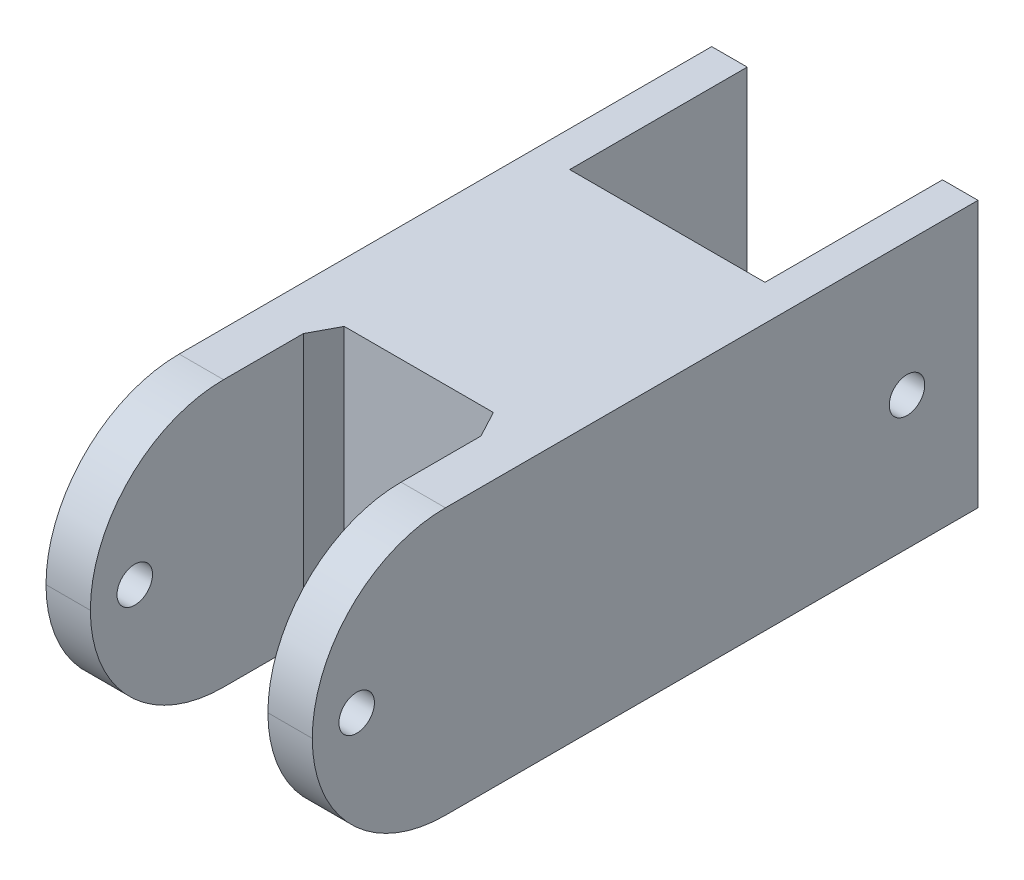
ISO-10303-21;
HEADER;
FILE_DESCRIPTION(('STEP AP214'),'2;1');
FILE_NAME('part.step','',(''),(''),'','','');
FILE_SCHEMA(('AUTOMOTIVE_DESIGN { 1 0 10303 214 1 1 1 1 }'));
ENDSEC;
DATA;
#1=APPLICATION_CONTEXT('core data for automotive mechanical design processes');
#2=APPLICATION_PROTOCOL_DEFINITION('international standard','automotive_design',2000,#1);
#3=PRODUCT_CONTEXT('',#1,'mechanical');
#4=PRODUCT('Part','Part','',(#3));
#5=PRODUCT_RELATED_PRODUCT_CATEGORY('part','',(#4));
#6=PRODUCT_DEFINITION_FORMATION('','',#4);
#7=PRODUCT_DEFINITION_CONTEXT('part definition',#1,'design');
#8=PRODUCT_DEFINITION('design','',#6,#7);
#9=PRODUCT_DEFINITION_SHAPE('','',#8);
#10=(LENGTH_UNIT() NAMED_UNIT(*) SI_UNIT(.MILLI.,.METRE.));
#11=(NAMED_UNIT(*) PLANE_ANGLE_UNIT() SI_UNIT($,.RADIAN.));
#12=(NAMED_UNIT(*) SI_UNIT($,.STERADIAN.) SOLID_ANGLE_UNIT());
#13=UNCERTAINTY_MEASURE_WITH_UNIT(LENGTH_MEASURE(1.E-05),#10,'distance_accuracy_value','');
#14=(GEOMETRIC_REPRESENTATION_CONTEXT(3) GLOBAL_UNCERTAINTY_ASSIGNED_CONTEXT((#13)) GLOBAL_UNIT_ASSIGNED_CONTEXT((#10,
#11,#12)) REPRESENTATION_CONTEXT('',''));
#15=CARTESIAN_POINT('',(0.,0.,0.));
#16=DIRECTION('',(0.,0.,1.));
#17=DIRECTION('',(1.,0.,0.));
#18=AXIS2_PLACEMENT_3D('',#15,#16,#17);
#19=CARTESIAN_POINT('',(0.,0.,-63.5));
#20=DIRECTION('',(0.,0.,-1.));
#21=DIRECTION('',(-1.,0.,0.));
#22=AXIS2_PLACEMENT_3D('',#19,#20,#21);
#23=PLANE('',#22);
#24=DIRECTION('',(-1.,0.,0.));
#25=VECTOR('',#24,1.);
#26=CARTESIAN_POINT('',(38.1,-19.05,-63.5));
#27=LINE('',#26,#25);
#28=CARTESIAN_POINT('',(33.02,-19.05,-63.5));
#29=VERTEX_POINT('',#28);
#30=CARTESIAN_POINT('',(5.08000000000001,-19.05,-63.5));
#31=VERTEX_POINT('',#30);
#32=EDGE_CURVE('E55',#29,#31,#27,.T.);
#33=ORIENTED_EDGE('',*,*,#32,.T.);
#34=DIRECTION('',(0.,-1.,0.));
#35=VECTOR('',#34,1.);
#36=CARTESIAN_POINT('',(5.08,19.05,-63.5));
#37=LINE('',#36,#35);
#38=CARTESIAN_POINT('',(5.07999999999999,19.05,-63.5));
#39=VERTEX_POINT('',#38);
#40=EDGE_CURVE('E50',#39,#31,#37,.T.);
#41=ORIENTED_EDGE('',*,*,#40,.F.);
#42=DIRECTION('',(1.,0.,0.));
#43=VECTOR('',#42,1.);
#44=CARTESIAN_POINT('',(0.,19.05,-63.5));
#45=LINE('',#44,#43);
#46=CARTESIAN_POINT('',(33.02,19.05,-63.5));
#47=VERTEX_POINT('',#46);
#48=EDGE_CURVE('E204',#39,#47,#45,.T.);
#49=ORIENTED_EDGE('',*,*,#48,.T.);
#50=DIRECTION('',(0.,1.,0.));
#51=VECTOR('',#50,1.);
#52=CARTESIAN_POINT('',(33.02,19.05,-63.5));
#53=LINE('',#52,#51);
#54=EDGE_CURVE('E184',#29,#47,#53,.T.);
#55=ORIENTED_EDGE('',*,*,#54,.F.);
#56=EDGE_LOOP('',(#33,#41,#49,#55));
#57=FACE_BOUND('',#56,.T.);
#58=ADVANCED_FACE('F33',(#57),#23,.T.);
#59=CARTESIAN_POINT('',(0.,19.05,0.));
#60=DIRECTION('',(0.,-1.,0.));
#61=DIRECTION('',(0.,0.,-1.));
#62=AXIS2_PLACEMENT_3D('',#59,#60,#61);
#63=PLANE('',#62);
#64=DIRECTION('',(0.,0.,1.));
#65=VECTOR('',#64,1.);
#66=CARTESIAN_POINT('',(0.,19.05,0.));
#67=LINE('',#66,#65);
#68=CARTESIAN_POINT('',(0.,19.05,-88.9));
#69=VERTEX_POINT('',#68);
#70=CARTESIAN_POINT('',(0.,19.05,-12.7));
#71=VERTEX_POINT('',#70);
#72=EDGE_CURVE('E145',#69,#71,#67,.T.);
#73=ORIENTED_EDGE('',*,*,#72,.T.);
#74=DIRECTION('',(1.,0.,0.));
#75=VECTOR('',#74,1.);
#76=CARTESIAN_POINT('',(0.,19.05,-12.7));
#77=LINE('',#76,#75);
#78=CARTESIAN_POINT('',(6.34999999999999,19.05,-12.7));
#79=VERTEX_POINT('',#78);
#80=EDGE_CURVE('E276',#71,#79,#77,.T.);
#81=ORIENTED_EDGE('',*,*,#80,.T.);
#82=DIRECTION('',(0.,0.,1.));
#83=VECTOR('',#82,1.);
#84=CARTESIAN_POINT('',(6.34999999999999,19.05,0.));
#85=LINE('',#84,#83);
#86=CARTESIAN_POINT('',(6.34999999999999,19.05,-24.13));
#87=VERTEX_POINT('',#86);
#88=EDGE_CURVE('E219',#87,#79,#85,.T.);
#89=ORIENTED_EDGE('',*,*,#88,.F.);
#90=DIRECTION('',(-0.470588235294118,0.,0.882352941176471));
#91=VECTOR('',#90,1.);
#92=CARTESIAN_POINT('',(8.38199999999999,19.05,-27.94));
#93=LINE('',#92,#91);
#94=CARTESIAN_POINT('',(8.38199999999999,19.05,-27.94));
#95=VERTEX_POINT('',#94);
#96=EDGE_CURVE('E216',#95,#87,#93,.T.);
#97=ORIENTED_EDGE('',*,*,#96,.F.);
#98=DIRECTION('',(-1.,0.,0.));
#99=VECTOR('',#98,1.);
#100=CARTESIAN_POINT('',(29.718,19.05,-27.94));
#101=LINE('',#100,#99);
#102=CARTESIAN_POINT('',(29.718,19.05,-27.94));
#103=VERTEX_POINT('',#102);
#104=EDGE_CURVE('E213',#103,#95,#101,.T.);
#105=ORIENTED_EDGE('',*,*,#104,.F.);
#106=DIRECTION('',(-0.470588235294116,0.,-0.882352941176472));
#107=VECTOR('',#106,1.);
#108=CARTESIAN_POINT('',(31.75,19.05,-24.13));
#109=LINE('',#108,#107);
#110=CARTESIAN_POINT('',(31.75,19.05,-24.13));
#111=VERTEX_POINT('',#110);
#112=EDGE_CURVE('E209',#111,#103,#109,.T.);
#113=ORIENTED_EDGE('',*,*,#112,.F.);
#114=DIRECTION('',(0.,0.,-1.));
#115=VECTOR('',#114,1.);
#116=CARTESIAN_POINT('',(31.75,19.05,0.));
#117=LINE('',#116,#115);
#118=CARTESIAN_POINT('',(31.75,19.05,-12.7));
#119=VERTEX_POINT('',#118);
#120=EDGE_CURVE('E207',#119,#111,#117,.T.);
#121=ORIENTED_EDGE('',*,*,#120,.F.);
#122=DIRECTION('',(1.,0.,0.));
#123=VECTOR('',#122,1.);
#124=CARTESIAN_POINT('',(0.,19.05,-12.7));
#125=LINE('',#124,#123);
#126=CARTESIAN_POINT('',(38.1,19.05,-12.7));
#127=VERTEX_POINT('',#126);
#128=EDGE_CURVE('E273',#119,#127,#125,.T.);
#129=ORIENTED_EDGE('',*,*,#128,.T.);
#130=DIRECTION('',(0.,0.,-1.));
#131=VECTOR('',#130,1.);
#132=CARTESIAN_POINT('',(38.1,19.05,0.));
#133=LINE('',#132,#131);
#134=CARTESIAN_POINT('',(38.1,19.05,-88.9));
#135=VERTEX_POINT('',#134);
#136=EDGE_CURVE('E156',#127,#135,#133,.T.);
#137=ORIENTED_EDGE('',*,*,#136,.T.);
#138=DIRECTION('',(1.,0.,0.));
#139=VECTOR('',#138,1.);
#140=CARTESIAN_POINT('',(38.1,19.05,-88.9));
#141=LINE('',#140,#139);
#142=CARTESIAN_POINT('',(33.02,19.05,-88.9));
#143=VERTEX_POINT('',#142);
#144=EDGE_CURVE('E192',#143,#135,#141,.T.);
#145=ORIENTED_EDGE('',*,*,#144,.F.);
#146=DIRECTION('',(0.,0.,1.));
#147=VECTOR('',#146,1.);
#148=CARTESIAN_POINT('',(33.02,19.05,-88.9));
#149=LINE('',#148,#147);
#150=EDGE_CURVE('E195',#143,#47,#149,.T.);
#151=ORIENTED_EDGE('',*,*,#150,.T.);
#152=ORIENTED_EDGE('',*,*,#48,.F.);
#153=DIRECTION('',(0.,0.,1.));
#154=VECTOR('',#153,1.);
#155=CARTESIAN_POINT('',(5.08,19.05,-88.9));
#156=LINE('',#155,#154);
#157=CARTESIAN_POINT('',(5.08,19.05,-88.9));
#158=VERTEX_POINT('',#157);
#159=EDGE_CURVE('E163',#158,#39,#156,.T.);
#160=ORIENTED_EDGE('',*,*,#159,.F.);
#161=DIRECTION('',(1.,0.,0.));
#162=VECTOR('',#161,1.);
#163=CARTESIAN_POINT('',(0.,19.05,-88.9));
#164=LINE('',#163,#162);
#165=EDGE_CURVE('E160',#69,#158,#164,.T.);
#166=ORIENTED_EDGE('',*,*,#165,.F.);
#167=EDGE_LOOP('',(#73,#81,#89,#97,#105,#113,#121,#129,#137,#145,#151,#152,#160,#166));
#168=FACE_BOUND('',#167,.T.);
#169=ADVANCED_FACE('F161',(#168),#63,.F.);
#170=CARTESIAN_POINT('',(0.,-19.05,0.));
#171=DIRECTION('',(0.,-1.,0.));
#172=DIRECTION('',(0.,0.,-1.));
#173=AXIS2_PLACEMENT_3D('',#170,#171,#172);
#174=PLANE('',#173);
#175=DIRECTION('',(0.,0.,1.));
#176=VECTOR('',#175,1.);
#177=CARTESIAN_POINT('',(6.34999999999999,-19.05,0.));
#178=LINE('',#177,#176);
#179=CARTESIAN_POINT('',(6.34999999999999,-19.05,-24.13));
#180=VERTEX_POINT('',#179);
#181=CARTESIAN_POINT('',(6.34999999999999,-19.05,-12.7));
#182=VERTEX_POINT('',#181);
#183=EDGE_CURVE('E233',#180,#182,#178,.T.);
#184=ORIENTED_EDGE('',*,*,#183,.T.);
#185=DIRECTION('',(1.,0.,0.));
#186=VECTOR('',#185,1.);
#187=CARTESIAN_POINT('',(0.,-19.05,-12.7));
#188=LINE('',#187,#186);
#189=CARTESIAN_POINT('',(0.,-19.05,-12.7));
#190=VERTEX_POINT('',#189);
#191=EDGE_CURVE('E267',#182,#190,#188,.F.);
#192=ORIENTED_EDGE('',*,*,#191,.T.);
#193=DIRECTION('',(0.,0.,1.));
#194=VECTOR('',#193,1.);
#195=CARTESIAN_POINT('',(0.,-19.05,0.));
#196=LINE('',#195,#194);
#197=CARTESIAN_POINT('',(0.,-19.05,-88.9));
#198=VERTEX_POINT('',#197);
#199=EDGE_CURVE('E247',#198,#190,#196,.T.);
#200=ORIENTED_EDGE('',*,*,#199,.F.);
#201=DIRECTION('',(-1.,0.,0.));
#202=VECTOR('',#201,1.);
#203=CARTESIAN_POINT('',(0.,-19.05,-88.9));
#204=LINE('',#203,#202);
#205=CARTESIAN_POINT('',(5.07999999999999,-19.05,-88.9));
#206=VERTEX_POINT('',#205);
#207=EDGE_CURVE('E171',#206,#198,#204,.T.);
#208=ORIENTED_EDGE('',*,*,#207,.F.);
#209=DIRECTION('',(0.,0.,1.));
#210=VECTOR('',#209,1.);
#211=CARTESIAN_POINT('',(5.07999999999999,-19.05,-88.9));
#212=LINE('',#211,#210);
#213=EDGE_CURVE('E179',#206,#31,#212,.T.);
#214=ORIENTED_EDGE('',*,*,#213,.T.);
#215=ORIENTED_EDGE('',*,*,#32,.F.);
#216=DIRECTION('',(0.,0.,1.));
#217=VECTOR('',#216,1.);
#218=CARTESIAN_POINT('',(33.02,-19.05,-88.9));
#219=LINE('',#218,#217);
#220=CARTESIAN_POINT('',(33.02,-19.05,-88.9));
#221=VERTEX_POINT('',#220);
#222=EDGE_CURVE('E200',#221,#29,#219,.T.);
#223=ORIENTED_EDGE('',*,*,#222,.F.);
#224=DIRECTION('',(-1.,0.,0.));
#225=VECTOR('',#224,1.);
#226=CARTESIAN_POINT('',(38.1,-19.05,-88.9));
#227=LINE('',#226,#225);
#228=CARTESIAN_POINT('',(38.1,-19.05,-88.9));
#229=VERTEX_POINT('',#228);
#230=EDGE_CURVE('E188',#229,#221,#227,.T.);
#231=ORIENTED_EDGE('',*,*,#230,.F.);
#232=DIRECTION('',(0.,0.,-1.));
#233=VECTOR('',#232,1.);
#234=CARTESIAN_POINT('',(38.1,-19.05,0.));
#235=LINE('',#234,#233);
#236=CARTESIAN_POINT('',(38.1,-19.05,-12.7));
#237=VERTEX_POINT('',#236);
#238=EDGE_CURVE('E157',#237,#229,#235,.T.);
#239=ORIENTED_EDGE('',*,*,#238,.F.);
#240=DIRECTION('',(1.,0.,0.));
#241=VECTOR('',#240,1.);
#242=CARTESIAN_POINT('',(31.75,-19.05,-12.7));
#243=LINE('',#242,#241);
#244=CARTESIAN_POINT('',(31.75,-19.05,-12.7));
#245=VERTEX_POINT('',#244);
#246=EDGE_CURVE('E265',#237,#245,#243,.F.);
#247=ORIENTED_EDGE('',*,*,#246,.T.);
#248=DIRECTION('',(0.,0.,-1.));
#249=VECTOR('',#248,1.);
#250=CARTESIAN_POINT('',(31.75,-19.05,0.));
#251=LINE('',#250,#249);
#252=CARTESIAN_POINT('',(31.75,-19.05,-24.13));
#253=VERTEX_POINT('',#252);
#254=EDGE_CURVE('E222',#245,#253,#251,.T.);
#255=ORIENTED_EDGE('',*,*,#254,.T.);
#256=DIRECTION('',(-0.470588235294116,0.,-0.882352941176472));
#257=VECTOR('',#256,1.);
#258=CARTESIAN_POINT('',(31.75,-19.05,-24.13));
#259=LINE('',#258,#257);
#260=CARTESIAN_POINT('',(29.718,-19.05,-27.94));
#261=VERTEX_POINT('',#260);
#262=EDGE_CURVE('E224',#253,#261,#259,.T.);
#263=ORIENTED_EDGE('',*,*,#262,.T.);
#264=DIRECTION('',(-1.,0.,0.));
#265=VECTOR('',#264,1.);
#266=CARTESIAN_POINT('',(29.718,-19.05,-27.94));
#267=LINE('',#266,#265);
#268=CARTESIAN_POINT('',(8.38199999999999,-19.05,-27.94));
#269=VERTEX_POINT('',#268);
#270=EDGE_CURVE('E227',#261,#269,#267,.T.);
#271=ORIENTED_EDGE('',*,*,#270,.T.);
#272=DIRECTION('',(-0.470588235294118,0.,0.882352941176471));
#273=VECTOR('',#272,1.);
#274=CARTESIAN_POINT('',(8.38199999999999,-19.05,-27.94));
#275=LINE('',#274,#273);
#276=EDGE_CURVE('E230',#269,#180,#275,.T.);
#277=ORIENTED_EDGE('',*,*,#276,.T.);
#278=EDGE_LOOP('',(#184,#192,#200,#208,#214,#215,#223,#231,#239,#247,#255,#263,#271,#277));
#279=FACE_BOUND('',#278,.T.);
#280=ADVANCED_FACE('F301',(#279),#174,.T.);
#281=CARTESIAN_POINT('',(0.,0.,0.));
#282=DIRECTION('',(1.,0.,0.));
#283=DIRECTION('',(0.,0.,-1.));
#284=AXIS2_PLACEMENT_3D('',#281,#282,#283);
#285=CYLINDRICAL_SURFACE('',#284,2.54);
#286=CARTESIAN_POINT('',(38.1,0.,0.));
#287=DIRECTION('',(-1.,0.,0.));
#288=DIRECTION('',(0.,0.,1.));
#289=AXIS2_PLACEMENT_3D('',#286,#287,#288);
#290=CIRCLE('',#289,2.54);
#291=CARTESIAN_POINT('',(38.1,0.,2.54));
#292=VERTEX_POINT('',#291);
#293=EDGE_CURVE('E250',#292,#292,#290,.T.);
#294=ORIENTED_EDGE('',*,*,#293,.F.);
#295=EDGE_LOOP('',(#294));
#296=FACE_BOUND('',#295,.T.);
#297=CARTESIAN_POINT('',(31.75,0.,0.));
#298=DIRECTION('',(1.,0.,0.));
#299=DIRECTION('',(0.,0.,-1.));
#300=AXIS2_PLACEMENT_3D('',#297,#298,#299);
#301=CIRCLE('',#300,2.54);
#302=CARTESIAN_POINT('',(31.75,0.,-2.54));
#303=VERTEX_POINT('',#302);
#304=EDGE_CURVE('E258',#303,#303,#301,.F.);
#305=ORIENTED_EDGE('',*,*,#304,.T.);
#306=EDGE_LOOP('',(#305));
#307=FACE_BOUND('',#306,.T.);
#308=ADVANCED_FACE('F364',(#296,#307),#285,.F.);
#309=CARTESIAN_POINT('',(0.,0.,0.));
#310=DIRECTION('',(1.,0.,0.));
#311=DIRECTION('',(0.,0.,-1.));
#312=AXIS2_PLACEMENT_3D('',#309,#310,#311);
#313=CIRCLE('',#312,2.54);
#314=CARTESIAN_POINT('',(0.,0.,-2.53999999999999));
#315=VERTEX_POINT('',#314);
#316=EDGE_CURVE('E239',#315,#315,#313,.T.);
#317=ORIENTED_EDGE('',*,*,#316,.F.);
#318=EDGE_LOOP('',(#317));
#319=FACE_BOUND('',#318,.T.);
#320=CARTESIAN_POINT('',(6.34999999999999,0.,0.));
#321=DIRECTION('',(-1.,0.,0.));
#322=DIRECTION('',(0.,0.,1.));
#323=AXIS2_PLACEMENT_3D('',#320,#321,#322);
#324=CIRCLE('',#323,2.54);
#325=CARTESIAN_POINT('',(6.34999999999999,0.,2.54000000000001));
#326=VERTEX_POINT('',#325);
#327=EDGE_CURVE('E255',#326,#326,#324,.F.);
#328=ORIENTED_EDGE('',*,*,#327,.T.);
#329=EDGE_LOOP('',(#328));
#330=FACE_BOUND('',#329,.T.);
#331=ADVANCED_FACE('F366',(#319,#330),#285,.F.);
#332=CARTESIAN_POINT('',(0.,19.05,0.));
#333=DIRECTION('',(1.,0.,0.));
#334=DIRECTION('',(0.,0.,-1.));
#335=AXIS2_PLACEMENT_3D('',#332,#333,#334);
#336=PLANE('',#335);
#337=CARTESIAN_POINT('',(0.,0.,-78.74));
#338=DIRECTION('',(1.,0.,0.));
#339=DIRECTION('',(0.,0.,-1.));
#340=AXIS2_PLACEMENT_3D('',#337,#338,#339);
#341=CIRCLE('',#340,2.54);
#342=CARTESIAN_POINT('',(0.,0.,-81.28));
#343=VERTEX_POINT('',#342);
#344=EDGE_CURVE('E382',#343,#343,#341,.T.);
#345=ORIENTED_EDGE('',*,*,#344,.T.);
#346=EDGE_LOOP('',(#345));
#347=FACE_BOUND('',#346,.T.);
#348=ORIENTED_EDGE('',*,*,#199,.T.);
#349=CARTESIAN_POINT('',(0.,0.,-12.7));
#350=DIRECTION('',(1.,0.,0.));
#351=DIRECTION('',(0.,0.,-1.));
#352=AXIS2_PLACEMENT_3D('',#349,#350,#351);
#353=CIRCLE('',#352,19.05);
#354=CARTESIAN_POINT('',(0.,0.,6.35));
#355=VERTEX_POINT('',#354);
#356=EDGE_CURVE('E271',#190,#355,#353,.F.);
#357=ORIENTED_EDGE('',*,*,#356,.T.);
#358=CARTESIAN_POINT('',(0.,0.,-12.7));
#359=DIRECTION('',(1.,0.,0.));
#360=DIRECTION('',(0.,0.,-1.));
#361=AXIS2_PLACEMENT_3D('',#358,#359,#360);
#362=CIRCLE('',#361,19.05);
#363=EDGE_CURVE('E153',#355,#71,#362,.F.);
#364=ORIENTED_EDGE('',*,*,#363,.T.);
#365=ORIENTED_EDGE('',*,*,#72,.F.);
#366=DIRECTION('',(0.,1.,0.));
#367=VECTOR('',#366,1.);
#368=CARTESIAN_POINT('',(0.,19.05,-88.9));
#369=LINE('',#368,#367);
#370=EDGE_CURVE('E151',#198,#69,#369,.T.);
#371=ORIENTED_EDGE('',*,*,#370,.F.);
#372=EDGE_LOOP('',(#348,#357,#364,#365,#371));
#373=FACE_BOUND('',#372,.T.);
#374=ORIENTED_EDGE('',*,*,#316,.T.);
#375=EDGE_LOOP('',(#374));
#376=FACE_BOUND('',#375,.T.);
#377=ADVANCED_FACE('F148',(#347,#373,#376),#336,.F.);
#378=CARTESIAN_POINT('',(38.1,19.05,0.));
#379=DIRECTION('',(-1.,0.,0.));
#380=DIRECTION('',(0.,0.,1.));
#381=AXIS2_PLACEMENT_3D('',#378,#379,#380);
#382=PLANE('',#381);
#383=CARTESIAN_POINT('',(38.1,0.,-78.74));
#384=DIRECTION('',(1.,0.,0.));
#385=DIRECTION('',(0.,0.,-1.));
#386=AXIS2_PLACEMENT_3D('',#383,#384,#385);
#387=CIRCLE('',#386,2.54);
#388=CARTESIAN_POINT('',(38.1,0.,-81.28));
#389=VERTEX_POINT('',#388);
#390=EDGE_CURVE('E384',#389,#389,#387,.T.);
#391=ORIENTED_EDGE('',*,*,#390,.F.);
#392=EDGE_LOOP('',(#391));
#393=FACE_BOUND('',#392,.T.);
#394=ORIENTED_EDGE('',*,*,#293,.T.);
#395=EDGE_LOOP('',(#394));
#396=FACE_BOUND('',#395,.T.);
#397=ORIENTED_EDGE('',*,*,#136,.F.);
#398=CARTESIAN_POINT('',(38.1,0.,-12.7));
#399=DIRECTION('',(-1.,0.,0.));
#400=DIRECTION('',(0.,0.,1.));
#401=AXIS2_PLACEMENT_3D('',#398,#399,#400);
#402=CIRCLE('',#401,19.05);
#403=CARTESIAN_POINT('',(38.1,0.,6.35));
#404=VERTEX_POINT('',#403);
#405=EDGE_CURVE('E280',#127,#404,#402,.F.);
#406=ORIENTED_EDGE('',*,*,#405,.T.);
#407=CARTESIAN_POINT('',(38.1,0.,-12.7));
#408=DIRECTION('',(-1.,0.,0.));
#409=DIRECTION('',(0.,0.,1.));
#410=AXIS2_PLACEMENT_3D('',#407,#408,#409);
#411=CIRCLE('',#410,19.05);
#412=EDGE_CURVE('E278',#404,#237,#411,.F.);
#413=ORIENTED_EDGE('',*,*,#412,.T.);
#414=ORIENTED_EDGE('',*,*,#238,.T.);
#415=DIRECTION('',(0.,-1.,0.));
#416=VECTOR('',#415,1.);
#417=CARTESIAN_POINT('',(38.1,19.05,-88.9));
#418=LINE('',#417,#416);
#419=EDGE_CURVE('E185',#135,#229,#418,.T.);
#420=ORIENTED_EDGE('',*,*,#419,.F.);
#421=EDGE_LOOP('',(#397,#406,#413,#414,#420));
#422=FACE_BOUND('',#421,.T.);
#423=ADVANCED_FACE('F297',(#393,#396,#422),#382,.F.);
#424=CARTESIAN_POINT('',(31.75,-19.05,0.));
#425=DIRECTION('',(1.,0.,0.));
#426=DIRECTION('',(0.,0.,-1.));
#427=AXIS2_PLACEMENT_3D('',#424,#425,#426);
#428=PLANE('',#427);
#429=CARTESIAN_POINT('',(31.75,0.,-12.7));
#430=DIRECTION('',(1.,0.,0.));
#431=DIRECTION('',(0.,0.,-1.));
#432=AXIS2_PLACEMENT_3D('',#429,#430,#431);
#433=CIRCLE('',#432,19.05);
#434=CARTESIAN_POINT('',(31.75,0.,6.35));
#435=VERTEX_POINT('',#434);
#436=EDGE_CURVE('E42',#245,#435,#433,.F.);
#437=ORIENTED_EDGE('',*,*,#436,.T.);
#438=CARTESIAN_POINT('',(31.75,0.,-12.7));
#439=DIRECTION('',(1.,0.,0.));
#440=DIRECTION('',(0.,0.,-1.));
#441=AXIS2_PLACEMENT_3D('',#438,#439,#440);
#442=CIRCLE('',#441,19.05);
#443=EDGE_CURVE('E11',#435,#119,#442,.F.);
#444=ORIENTED_EDGE('',*,*,#443,.T.);
#445=ORIENTED_EDGE('',*,*,#120,.T.);
#446=DIRECTION('',(0.,1.,0.));
#447=VECTOR('',#446,1.);
#448=CARTESIAN_POINT('',(31.75,-19.05,-24.13));
#449=LINE('',#448,#447);
#450=EDGE_CURVE('E236',#253,#111,#449,.T.);
#451=ORIENTED_EDGE('',*,*,#450,.F.);
#452=ORIENTED_EDGE('',*,*,#254,.F.);
#453=EDGE_LOOP('',(#437,#444,#445,#451,#452));
#454=FACE_BOUND('',#453,.T.);
#455=ORIENTED_EDGE('',*,*,#304,.F.);
#456=EDGE_LOOP('',(#455));
#457=FACE_BOUND('',#456,.T.);
#458=ADVANCED_FACE('F313',(#454,#457),#428,.F.);
#459=CARTESIAN_POINT('',(6.34999999999999,-19.05,0.));
#460=DIRECTION('',(-1.,0.,0.));
#461=DIRECTION('',(0.,0.,1.));
#462=AXIS2_PLACEMENT_3D('',#459,#460,#461);
#463=PLANE('',#462);
#464=ORIENTED_EDGE('',*,*,#327,.F.);
#465=EDGE_LOOP('',(#464));
#466=FACE_BOUND('',#465,.T.);
#467=CARTESIAN_POINT('',(6.34999999999999,0.,-12.7));
#468=DIRECTION('',(-1.,0.,0.));
#469=DIRECTION('',(0.,0.,1.));
#470=AXIS2_PLACEMENT_3D('',#467,#468,#469);
#471=CIRCLE('',#470,19.05);
#472=CARTESIAN_POINT('',(6.34999999999999,0.,6.35));
#473=VERTEX_POINT('',#472);
#474=EDGE_CURVE('E261',#79,#473,#471,.F.);
#475=ORIENTED_EDGE('',*,*,#474,.T.);
#476=CARTESIAN_POINT('',(6.34999999999999,0.,-12.7));
#477=DIRECTION('',(-1.,0.,0.));
#478=DIRECTION('',(0.,0.,1.));
#479=AXIS2_PLACEMENT_3D('',#476,#477,#478);
#480=CIRCLE('',#479,19.05);
#481=EDGE_CURVE('E263',#473,#182,#480,.F.);
#482=ORIENTED_EDGE('',*,*,#481,.T.);
#483=ORIENTED_EDGE('',*,*,#183,.F.);
#484=DIRECTION('',(0.,1.,0.));
#485=VECTOR('',#484,1.);
#486=CARTESIAN_POINT('',(6.34999999999999,-19.05,-24.13));
#487=LINE('',#486,#485);
#488=EDGE_CURVE('E237',#180,#87,#487,.T.);
#489=ORIENTED_EDGE('',*,*,#488,.T.);
#490=ORIENTED_EDGE('',*,*,#88,.T.);
#491=EDGE_LOOP('',(#475,#482,#483,#489,#490));
#492=FACE_BOUND('',#491,.T.);
#493=ADVANCED_FACE('F328',(#466,#492),#463,.F.);
#494=CARTESIAN_POINT('',(8.38199999999999,-19.05,-27.94));
#495=DIRECTION('',(-0.88235294117647,0.,-0.470588235294118));
#496=DIRECTION('',(-0.470588235294118,0.,0.882352941176471));
#497=AXIS2_PLACEMENT_3D('',#494,#495,#496);
#498=PLANE('',#497);
#499=ORIENTED_EDGE('',*,*,#488,.F.);
#500=ORIENTED_EDGE('',*,*,#276,.F.);
#501=DIRECTION('',(0.,1.,0.));
#502=VECTOR('',#501,1.);
#503=CARTESIAN_POINT('',(8.38199999999999,-19.05,-27.94));
#504=LINE('',#503,#502);
#505=EDGE_CURVE('E240',#269,#95,#504,.T.);
#506=ORIENTED_EDGE('',*,*,#505,.T.);
#507=ORIENTED_EDGE('',*,*,#96,.T.);
#508=EDGE_LOOP('',(#499,#500,#506,#507));
#509=FACE_BOUND('',#508,.T.);
#510=ADVANCED_FACE('F324',(#509),#498,.F.);
#511=CARTESIAN_POINT('',(29.718,-19.05,-27.94));
#512=DIRECTION('',(0.,0.,-1.));
#513=DIRECTION('',(-1.,0.,0.));
#514=AXIS2_PLACEMENT_3D('',#511,#512,#513);
#515=PLANE('',#514);
#516=ORIENTED_EDGE('',*,*,#505,.F.);
#517=ORIENTED_EDGE('',*,*,#270,.F.);
#518=DIRECTION('',(0.,1.,0.));
#519=VECTOR('',#518,1.);
#520=CARTESIAN_POINT('',(29.718,-19.05,-27.94));
#521=LINE('',#520,#519);
#522=EDGE_CURVE('E242',#261,#103,#521,.T.);
#523=ORIENTED_EDGE('',*,*,#522,.T.);
#524=ORIENTED_EDGE('',*,*,#104,.T.);
#525=EDGE_LOOP('',(#516,#517,#523,#524));
#526=FACE_BOUND('',#525,.T.);
#527=ADVANCED_FACE('F321',(#526),#515,.F.);
#528=CARTESIAN_POINT('',(31.75,-19.05,-24.13));
#529=DIRECTION('',(0.882352941176472,0.,-0.470588235294115));
#530=DIRECTION('',(-0.470588235294116,0.,-0.882352941176472));
#531=AXIS2_PLACEMENT_3D('',#528,#529,#530);
#532=PLANE('',#531);
#533=ORIENTED_EDGE('',*,*,#522,.F.);
#534=ORIENTED_EDGE('',*,*,#262,.F.);
#535=ORIENTED_EDGE('',*,*,#450,.T.);
#536=ORIENTED_EDGE('',*,*,#112,.T.);
#537=EDGE_LOOP('',(#533,#534,#535,#536));
#538=FACE_BOUND('',#537,.T.);
#539=ADVANCED_FACE('F317',(#538),#532,.F.);
#540=CARTESIAN_POINT('',(0.,0.,-12.7));
#541=DIRECTION('',(1.,0.,0.));
#542=DIRECTION('',(0.,0.,-1.));
#543=AXIS2_PLACEMENT_3D('',#540,#541,#542);
#544=CYLINDRICAL_SURFACE('',#543,19.05);
#545=ORIENTED_EDGE('',*,*,#80,.F.);
#546=ORIENTED_EDGE('',*,*,#363,.F.);
#547=DIRECTION('',(1.,0.,0.));
#548=VECTOR('',#547,1.);
#549=CARTESIAN_POINT('',(0.,0.,6.35));
#550=LINE('',#549,#548);
#551=EDGE_CURVE('E210',#473,#355,#550,.F.);
#552=ORIENTED_EDGE('',*,*,#551,.F.);
#553=ORIENTED_EDGE('',*,*,#474,.F.);
#554=EDGE_LOOP('',(#545,#546,#552,#553));
#555=FACE_BOUND('',#554,.T.);
#556=ADVANCED_FACE('F335',(#555),#544,.T.);
#557=CARTESIAN_POINT('',(0.,0.,-12.7));
#558=DIRECTION('',(-1.,0.,0.));
#559=DIRECTION('',(0.,0.,1.));
#560=AXIS2_PLACEMENT_3D('',#557,#558,#559);
#561=CYLINDRICAL_SURFACE('',#560,19.05);
#562=ORIENTED_EDGE('',*,*,#356,.F.);
#563=ORIENTED_EDGE('',*,*,#191,.F.);
#564=ORIENTED_EDGE('',*,*,#481,.F.);
#565=ORIENTED_EDGE('',*,*,#551,.T.);
#566=EDGE_LOOP('',(#562,#563,#564,#565));
#567=FACE_BOUND('',#566,.T.);
#568=ADVANCED_FACE('F332',(#567),#561,.T.);
#569=CARTESIAN_POINT('',(0.,0.,-12.7));
#570=DIRECTION('',(-1.,0.,0.));
#571=DIRECTION('',(0.,0.,1.));
#572=AXIS2_PLACEMENT_3D('',#569,#570,#571);
#573=CYLINDRICAL_SURFACE('',#572,19.05);
#574=DIRECTION('',(1.,0.,0.));
#575=VECTOR('',#574,1.);
#576=CARTESIAN_POINT('',(38.1,0.,6.35));
#577=LINE('',#576,#575);
#578=EDGE_CURVE('E206',#435,#404,#577,.T.);
#579=ORIENTED_EDGE('',*,*,#578,.F.);
#580=ORIENTED_EDGE('',*,*,#436,.F.);
#581=ORIENTED_EDGE('',*,*,#246,.F.);
#582=ORIENTED_EDGE('',*,*,#412,.F.);
#583=EDGE_LOOP('',(#579,#580,#581,#582));
#584=FACE_BOUND('',#583,.T.);
#585=ADVANCED_FACE('F35',(#584),#573,.T.);
#586=CARTESIAN_POINT('',(0.,0.,-12.7));
#587=DIRECTION('',(1.,0.,0.));
#588=DIRECTION('',(0.,0.,-1.));
#589=AXIS2_PLACEMENT_3D('',#586,#587,#588);
#590=CYLINDRICAL_SURFACE('',#589,19.05);
#591=ORIENTED_EDGE('',*,*,#443,.F.);
#592=ORIENTED_EDGE('',*,*,#578,.T.);
#593=ORIENTED_EDGE('',*,*,#405,.F.);
#594=ORIENTED_EDGE('',*,*,#128,.F.);
#595=EDGE_LOOP('',(#591,#592,#593,#594));
#596=FACE_BOUND('',#595,.T.);
#597=ADVANCED_FACE('F288',(#596),#590,.T.);
#598=CARTESIAN_POINT('',(33.02,19.05,-88.9));
#599=DIRECTION('',(1.,0.,0.));
#600=DIRECTION('',(0.,1.,0.));
#601=AXIS2_PLACEMENT_3D('',#598,#599,#600);
#602=PLANE('',#601);
#603=CARTESIAN_POINT('',(33.02,0.,-78.74));
#604=DIRECTION('',(1.,0.,0.));
#605=DIRECTION('',(0.,1.,0.));
#606=AXIS2_PLACEMENT_3D('',#603,#604,#605);
#607=CIRCLE('',#606,2.54);
#608=CARTESIAN_POINT('',(33.02,2.54,-78.74));
#609=VERTEX_POINT('',#608);
#610=EDGE_CURVE('E173',#609,#609,#607,.T.);
#611=ORIENTED_EDGE('',*,*,#610,.T.);
#612=EDGE_LOOP('',(#611));
#613=FACE_BOUND('',#612,.T.);
#614=ORIENTED_EDGE('',*,*,#54,.T.);
#615=ORIENTED_EDGE('',*,*,#150,.F.);
#616=DIRECTION('',(0.,1.,0.));
#617=VECTOR('',#616,1.);
#618=CARTESIAN_POINT('',(33.02,19.05,-88.9));
#619=LINE('',#618,#617);
#620=EDGE_CURVE('E190',#221,#143,#619,.T.);
#621=ORIENTED_EDGE('',*,*,#620,.F.);
#622=ORIENTED_EDGE('',*,*,#222,.T.);
#623=EDGE_LOOP('',(#614,#615,#621,#622));
#624=FACE_BOUND('',#623,.T.);
#625=ADVANCED_FACE('F353',(#613,#624),#602,.F.);
#626=CARTESIAN_POINT('',(0.,0.,-88.9));
#627=DIRECTION('',(0.,0.,-1.));
#628=DIRECTION('',(-1.,0.,0.));
#629=AXIS2_PLACEMENT_3D('',#626,#627,#628);
#630=PLANE('',#629);
#631=ORIENTED_EDGE('',*,*,#419,.T.);
#632=ORIENTED_EDGE('',*,*,#230,.T.);
#633=ORIENTED_EDGE('',*,*,#620,.T.);
#634=ORIENTED_EDGE('',*,*,#144,.T.);
#635=EDGE_LOOP('',(#631,#632,#633,#634));
#636=FACE_BOUND('',#635,.T.);
#637=ADVANCED_FACE('F306',(#636),#630,.T.);
#638=CARTESIAN_POINT('',(5.08,19.05,-88.9));
#639=DIRECTION('',(-1.,0.,0.));
#640=DIRECTION('',(0.,-1.,0.));
#641=AXIS2_PLACEMENT_3D('',#638,#639,#640);
#642=PLANE('',#641);
#643=CARTESIAN_POINT('',(5.08,0.,-78.74));
#644=DIRECTION('',(-1.,0.,0.));
#645=DIRECTION('',(0.,-1.,0.));
#646=AXIS2_PLACEMENT_3D('',#643,#644,#645);
#647=CIRCLE('',#646,2.54);
#648=CARTESIAN_POINT('',(5.08,-2.54,-78.74));
#649=VERTEX_POINT('',#648);
#650=EDGE_CURVE('E37',#649,#649,#647,.T.);
#651=ORIENTED_EDGE('',*,*,#650,.T.);
#652=EDGE_LOOP('',(#651));
#653=FACE_BOUND('',#652,.T.);
#654=ORIENTED_EDGE('',*,*,#40,.T.);
#655=ORIENTED_EDGE('',*,*,#213,.F.);
#656=DIRECTION('',(0.,-1.,0.));
#657=VECTOR('',#656,1.);
#658=CARTESIAN_POINT('',(5.08,19.05,-88.9));
#659=LINE('',#658,#657);
#660=EDGE_CURVE('E166',#158,#206,#659,.T.);
#661=ORIENTED_EDGE('',*,*,#660,.F.);
#662=ORIENTED_EDGE('',*,*,#159,.T.);
#663=EDGE_LOOP('',(#654,#655,#661,#662));
#664=FACE_BOUND('',#663,.T.);
#665=ADVANCED_FACE('F406',(#653,#664),#642,.F.);
#666=CARTESIAN_POINT('',(0.,0.,-88.9));
#667=DIRECTION('',(0.,0.,1.));
#668=DIRECTION('',(1.,0.,0.));
#669=AXIS2_PLACEMENT_3D('',#666,#667,#668);
#670=PLANE('',#669);
#671=ORIENTED_EDGE('',*,*,#370,.T.);
#672=ORIENTED_EDGE('',*,*,#165,.T.);
#673=ORIENTED_EDGE('',*,*,#660,.T.);
#674=ORIENTED_EDGE('',*,*,#207,.T.);
#675=EDGE_LOOP('',(#671,#672,#673,#674));
#676=FACE_BOUND('',#675,.T.);
#677=ADVANCED_FACE('F169',(#676),#670,.F.);
#678=CARTESIAN_POINT('',(0.,0.,-78.74));
#679=DIRECTION('',(1.,0.,0.));
#680=DIRECTION('',(0.,0.,-1.));
#681=AXIS2_PLACEMENT_3D('',#678,#679,#680);
#682=CYLINDRICAL_SURFACE('',#681,2.54);
#683=ORIENTED_EDGE('',*,*,#344,.F.);
#684=EDGE_LOOP('',(#683));
#685=FACE_BOUND('',#684,.T.);
#686=ORIENTED_EDGE('',*,*,#650,.F.);
#687=EDGE_LOOP('',(#686));
#688=FACE_BOUND('',#687,.T.);
#689=ADVANCED_FACE('F397',(#685,#688),#682,.F.);
#690=ORIENTED_EDGE('',*,*,#390,.T.);
#691=EDGE_LOOP('',(#690));
#692=FACE_BOUND('',#691,.T.);
#693=ORIENTED_EDGE('',*,*,#610,.F.);
#694=EDGE_LOOP('',(#693));
#695=FACE_BOUND('',#694,.T.);
#696=ADVANCED_FACE('F390',(#692,#695),#682,.F.);
#697=CLOSED_SHELL('',(#58,#169,#280,#308,#331,#377,#423,#458,#493,#510,#527,#539,#556,#568,#585,
#597,#625,#637,#665,#677,#689,#696));
#698=MANIFOLD_SOLID_BREP('B2',#697);
#699=ADVANCED_BREP_SHAPE_REPRESENTATION('',(#18,#698),#14);
#700=SHAPE_DEFINITION_REPRESENTATION(#9,#699);
ENDSEC;
END-ISO-10303-21;
